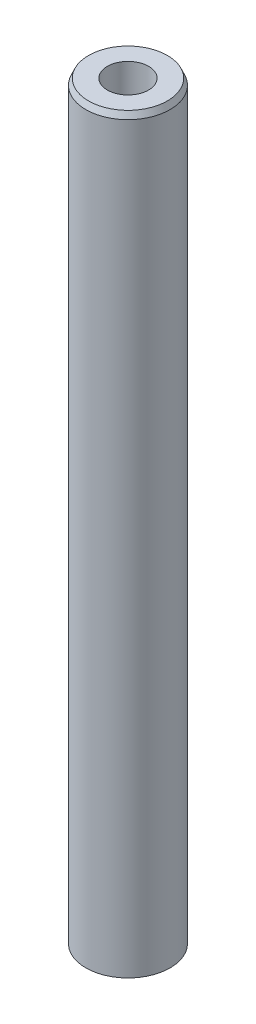
ISO-10303-21;
HEADER;
FILE_DESCRIPTION(('STEP AP214'),'2;1');
FILE_NAME('part.step','',(''),(''),'','','');
FILE_SCHEMA(('AUTOMOTIVE_DESIGN { 1 0 10303 214 1 1 1 1 }'));
ENDSEC;
DATA;
#1=APPLICATION_CONTEXT('core data for automotive mechanical design processes');
#2=APPLICATION_PROTOCOL_DEFINITION('international standard','automotive_design',2000,#1);
#3=PRODUCT_CONTEXT('',#1,'mechanical');
#4=PRODUCT('Part','Part','',(#3));
#5=PRODUCT_RELATED_PRODUCT_CATEGORY('part','',(#4));
#6=PRODUCT_DEFINITION_FORMATION('','',#4);
#7=PRODUCT_DEFINITION_CONTEXT('part definition',#1,'design');
#8=PRODUCT_DEFINITION('design','',#6,#7);
#9=PRODUCT_DEFINITION_SHAPE('','',#8);
#10=(LENGTH_UNIT() NAMED_UNIT(*) SI_UNIT(.MILLI.,.METRE.));
#11=(NAMED_UNIT(*) PLANE_ANGLE_UNIT() SI_UNIT($,.RADIAN.));
#12=(NAMED_UNIT(*) SI_UNIT($,.STERADIAN.) SOLID_ANGLE_UNIT());
#13=UNCERTAINTY_MEASURE_WITH_UNIT(LENGTH_MEASURE(1.E-05),#10,'distance_accuracy_value','');
#14=(GEOMETRIC_REPRESENTATION_CONTEXT(3) GLOBAL_UNCERTAINTY_ASSIGNED_CONTEXT((#13)) GLOBAL_UNIT_ASSIGNED_CONTEXT((#10,
#11,#12)) REPRESENTATION_CONTEXT('',''));
#15=CARTESIAN_POINT('',(0.,0.,0.));
#16=DIRECTION('',(0.,0.,1.));
#17=DIRECTION('',(1.,0.,0.));
#18=AXIS2_PLACEMENT_3D('',#15,#16,#17);
#19=CARTESIAN_POINT('',(0.,223.278673938508,0.));
#20=DIRECTION('',(0.,-1.,0.));
#21=DIRECTION('',(0.,0.,-1.));
#22=AXIS2_PLACEMENT_3D('',#19,#20,#21);
#23=CYLINDRICAL_SURFACE('',#22,12.5);
#24=CARTESIAN_POINT('',(0.,221.444665003229,0.));
#25=DIRECTION('',(0.,1.,0.));
#26=DIRECTION('',(0.,0.,1.));
#27=AXIS2_PLACEMENT_3D('',#24,#25,#26);
#28=CIRCLE('',#27,12.5);
#29=CARTESIAN_POINT('',(0.,221.444665003229,12.5));
#30=VERTEX_POINT('',#29);
#31=EDGE_CURVE('E50',#30,#30,#28,.F.);
#32=ORIENTED_EDGE('',*,*,#31,.T.);
#33=EDGE_LOOP('',(#32));
#34=FACE_BOUND('',#33,.T.);
#35=CARTESIAN_POINT('',(0.,0.799764474802539,0.));
#36=DIRECTION('',(0.,1.,0.));
#37=DIRECTION('',(0.,0.,1.));
#38=AXIS2_PLACEMENT_3D('',#35,#36,#37);
#39=CIRCLE('',#38,12.5);
#40=CARTESIAN_POINT('',(0.,0.799764474802539,12.5));
#41=VERTEX_POINT('',#40);
#42=EDGE_CURVE('E51',#41,#41,#39,.T.);
#43=ORIENTED_EDGE('',*,*,#42,.T.);
#44=EDGE_LOOP('',(#43));
#45=FACE_BOUND('',#44,.T.);
#46=ADVANCED_FACE('F39',(#34,#45),#23,.T.);
#47=CARTESIAN_POINT('',(0.,223.278673938508,0.));
#48=DIRECTION('',(0.,1.,0.));
#49=DIRECTION('',(0.,0.,1.));
#50=AXIS2_PLACEMENT_3D('',#47,#48,#49);
#51=PLANE('',#50);
#52=CARTESIAN_POINT('',(0.,223.278673938508,0.));
#53=DIRECTION('',(0.,1.,0.));
#54=DIRECTION('',(0.,0.,1.));
#55=AXIS2_PLACEMENT_3D('',#52,#53,#54);
#56=CIRCLE('',#55,11.7002355251975);
#57=CARTESIAN_POINT('',(0.,223.278673938508,11.7002355251975));
#58=VERTEX_POINT('',#57);
#59=EDGE_CURVE('E54',#58,#58,#56,.T.);
#60=ORIENTED_EDGE('',*,*,#59,.T.);
#61=EDGE_LOOP('',(#60));
#62=FACE_BOUND('',#61,.T.);
#63=CARTESIAN_POINT('',(0.,223.278673938508,0.));
#64=DIRECTION('',(0.,1.,0.));
#65=DIRECTION('',(0.,0.,1.));
#66=AXIS2_PLACEMENT_3D('',#63,#64,#65);
#67=CIRCLE('',#66,6.11438037632528);
#68=CARTESIAN_POINT('',(0.,223.278673938508,6.11438037632528));
#69=VERTEX_POINT('',#68);
#70=EDGE_CURVE('E58',#69,#69,#67,.T.);
#71=ORIENTED_EDGE('',*,*,#70,.F.);
#72=EDGE_LOOP('',(#71));
#73=FACE_BOUND('',#72,.T.);
#74=ADVANCED_FACE('F69',(#62,#73),#51,.T.);
#75=CARTESIAN_POINT('',(0.,0.,0.));
#76=DIRECTION('',(0.,1.,0.));
#77=DIRECTION('',(0.,0.,1.));
#78=AXIS2_PLACEMENT_3D('',#75,#76,#77);
#79=PLANE('',#78);
#80=CARTESIAN_POINT('',(0.,0.,0.));
#81=DIRECTION('',(0.,1.,0.));
#82=DIRECTION('',(0.,0.,1.));
#83=AXIS2_PLACEMENT_3D('',#80,#81,#82);
#84=CIRCLE('',#83,10.6659910647208);
#85=CARTESIAN_POINT('',(0.,0.,10.6659910647208));
#86=VERTEX_POINT('',#85);
#87=EDGE_CURVE('E10',#86,#86,#84,.F.);
#88=ORIENTED_EDGE('',*,*,#87,.T.);
#89=EDGE_LOOP('',(#88));
#90=FACE_BOUND('',#89,.T.);
#91=CARTESIAN_POINT('',(0.,0.,0.));
#92=DIRECTION('',(0.,1.,0.));
#93=DIRECTION('',(0.,0.,1.));
#94=AXIS2_PLACEMENT_3D('',#91,#92,#93);
#95=CIRCLE('',#94,6.11438037632528);
#96=CARTESIAN_POINT('',(0.,0.,6.11438037632528));
#97=VERTEX_POINT('',#96);
#98=EDGE_CURVE('E63',#97,#97,#95,.T.);
#99=ORIENTED_EDGE('',*,*,#98,.T.);
#100=EDGE_LOOP('',(#99));
#101=FACE_BOUND('',#100,.T.);
#102=ADVANCED_FACE('F75',(#90,#101),#79,.F.);
#103=CARTESIAN_POINT('',(0.,223.278673938508,0.));
#104=DIRECTION('',(0.,-1.,0.));
#105=DIRECTION('',(0.,0.,-1.));
#106=AXIS2_PLACEMENT_3D('',#103,#104,#105);
#107=CYLINDRICAL_SURFACE('',#106,6.11438037632528);
#108=ORIENTED_EDGE('',*,*,#70,.T.);
#109=EDGE_LOOP('',(#108));
#110=FACE_BOUND('',#109,.T.);
#111=ORIENTED_EDGE('',*,*,#98,.F.);
#112=EDGE_LOOP('',(#111));
#113=FACE_BOUND('',#112,.T.);
#114=ADVANCED_FACE('F70',(#110,#113),#107,.F.);
#115=CARTESIAN_POINT('',(0.,223.278673938508,0.));
#116=DIRECTION('',(0.,-1.,0.));
#117=DIRECTION('',(0.,0.,-1.));
#118=AXIS2_PLACEMENT_3D('',#115,#116,#117);
#119=CONICAL_SURFACE('',#118,11.7002355251975,0.411213305245702);
#120=ORIENTED_EDGE('',*,*,#31,.F.);
#121=EDGE_LOOP('',(#120));
#122=FACE_BOUND('',#121,.T.);
#123=ORIENTED_EDGE('',*,*,#59,.F.);
#124=EDGE_LOOP('',(#123));
#125=FACE_BOUND('',#124,.T.);
#126=ADVANCED_FACE('F81',(#122,#125),#119,.T.);
#127=CARTESIAN_POINT('',(0.,0.799764474802539,0.));
#128=DIRECTION('',(0.,1.,0.));
#129=DIRECTION('',(0.,0.,1.));
#130=AXIS2_PLACEMENT_3D('',#127,#128,#129);
#131=CONICAL_SURFACE('',#130,12.5,1.15958302154919);
#132=ORIENTED_EDGE('',*,*,#87,.F.);
#133=EDGE_LOOP('',(#132));
#134=FACE_BOUND('',#133,.T.);
#135=ORIENTED_EDGE('',*,*,#42,.F.);
#136=EDGE_LOOP('',(#135));
#137=FACE_BOUND('',#136,.T.);
#138=ADVANCED_FACE('F45',(#134,#137),#131,.T.);
#139=CLOSED_SHELL('',(#46,#74,#102,#114,#126,#138));
#140=MANIFOLD_SOLID_BREP('B2',#139);
#141=ADVANCED_BREP_SHAPE_REPRESENTATION('',(#18,#140),#14);
#142=SHAPE_DEFINITION_REPRESENTATION(#9,#141);
ENDSEC;
END-ISO-10303-21;
